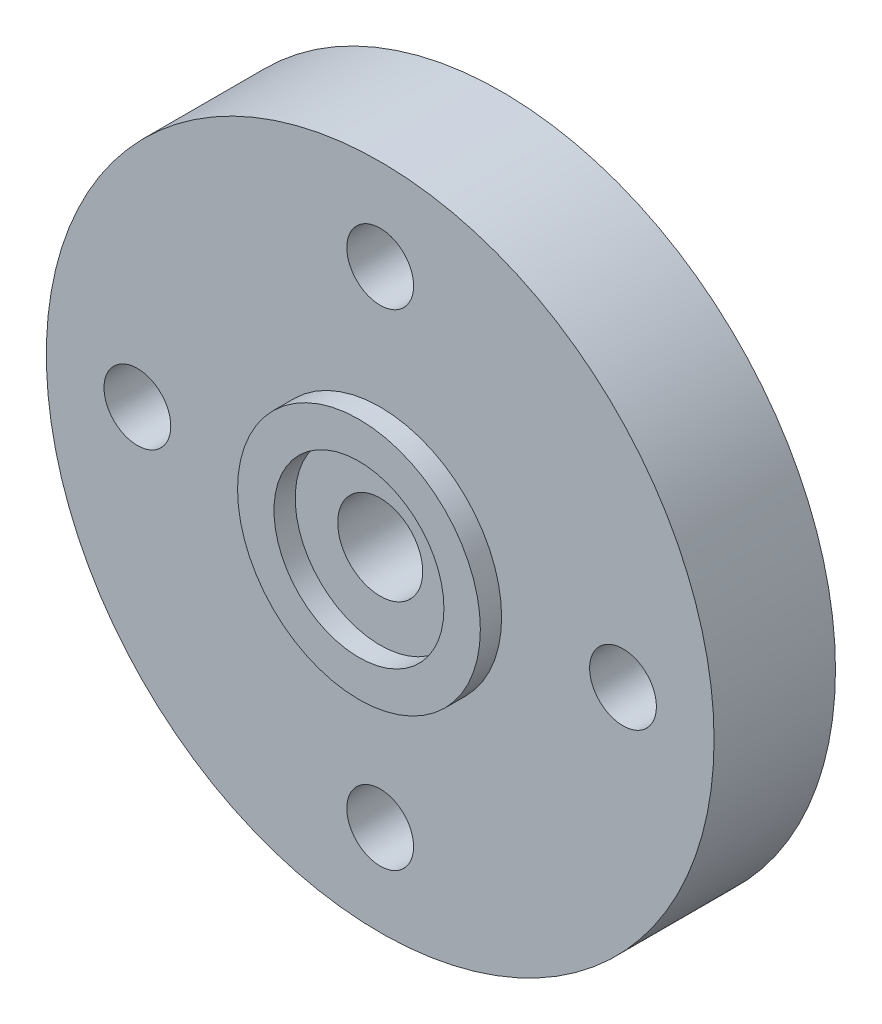
ISO-10303-21;
HEADER;
FILE_DESCRIPTION(('STEP AP214'),'2;1');
FILE_NAME('part.step','',(''),(''),'','','');
FILE_SCHEMA(('AUTOMOTIVE_DESIGN { 1 0 10303 214 1 1 1 1 }'));
ENDSEC;
DATA;
#1=APPLICATION_CONTEXT('core data for automotive mechanical design processes');
#2=APPLICATION_PROTOCOL_DEFINITION('international standard','automotive_design',2000,#1);
#3=PRODUCT_CONTEXT('',#1,'mechanical');
#4=PRODUCT('Part','Part','',(#3));
#5=PRODUCT_RELATED_PRODUCT_CATEGORY('part','',(#4));
#6=PRODUCT_DEFINITION_FORMATION('','',#4);
#7=PRODUCT_DEFINITION_CONTEXT('part definition',#1,'design');
#8=PRODUCT_DEFINITION('design','',#6,#7);
#9=PRODUCT_DEFINITION_SHAPE('','',#8);
#10=(LENGTH_UNIT() NAMED_UNIT(*) SI_UNIT(.MILLI.,.METRE.));
#11=(NAMED_UNIT(*) PLANE_ANGLE_UNIT() SI_UNIT($,.RADIAN.));
#12=(NAMED_UNIT(*) SI_UNIT($,.STERADIAN.) SOLID_ANGLE_UNIT());
#13=UNCERTAINTY_MEASURE_WITH_UNIT(LENGTH_MEASURE(1.E-05),#10,'distance_accuracy_value','');
#14=(GEOMETRIC_REPRESENTATION_CONTEXT(3) GLOBAL_UNCERTAINTY_ASSIGNED_CONTEXT((#13)) GLOBAL_UNIT_ASSIGNED_CONTEXT((#10,
#11,#12)) REPRESENTATION_CONTEXT('',''));
#15=CARTESIAN_POINT('',(0.,0.,0.));
#16=DIRECTION('',(0.,0.,1.));
#17=DIRECTION('',(1.,0.,0.));
#18=AXIS2_PLACEMENT_3D('',#15,#16,#17);
#19=CARTESIAN_POINT('',(0.,0.,4.));
#20=DIRECTION('',(0.,0.,1.));
#21=DIRECTION('',(1.,0.,0.));
#22=AXIS2_PLACEMENT_3D('',#19,#20,#21);
#23=PLANE('',#22);
#24=CARTESIAN_POINT('',(8.,0.,4.));
#25=DIRECTION('',(0.,0.,1.));
#26=DIRECTION('',(1.,0.,0.));
#27=AXIS2_PLACEMENT_3D('',#24,#25,#26);
#28=CIRCLE('',#27,1.1);
#29=CARTESIAN_POINT('',(9.1,0.,4.));
#30=VERTEX_POINT('',#29);
#31=EDGE_CURVE('E55',#30,#30,#28,.T.);
#32=ORIENTED_EDGE('',*,*,#31,.F.);
#33=EDGE_LOOP('',(#32));
#34=FACE_BOUND('',#33,.T.);
#35=CARTESIAN_POINT('',(0.,8.,4.));
#36=DIRECTION('',(0.,0.,1.));
#37=DIRECTION('',(1.,0.,0.));
#38=AXIS2_PLACEMENT_3D('',#35,#36,#37);
#39=CIRCLE('',#38,1.1);
#40=CARTESIAN_POINT('',(1.1,8.,4.));
#41=VERTEX_POINT('',#40);
#42=EDGE_CURVE('E44',#41,#41,#39,.T.);
#43=ORIENTED_EDGE('',*,*,#42,.F.);
#44=EDGE_LOOP('',(#43));
#45=FACE_BOUND('',#44,.T.);
#46=CARTESIAN_POINT('',(0.,0.,4.));
#47=DIRECTION('',(0.,0.,1.));
#48=DIRECTION('',(1.,0.,0.));
#49=AXIS2_PLACEMENT_3D('',#46,#47,#48);
#50=CIRCLE('',#49,11.);
#51=CARTESIAN_POINT('',(11.,0.,4.));
#52=VERTEX_POINT('',#51);
#53=EDGE_CURVE('E35',#52,#52,#50,.T.);
#54=ORIENTED_EDGE('',*,*,#53,.T.);
#55=EDGE_LOOP('',(#54));
#56=FACE_BOUND('',#55,.T.);
#57=CARTESIAN_POINT('',(-8.,0.,4.));
#58=DIRECTION('',(0.,0.,1.));
#59=DIRECTION('',(1.,0.,0.));
#60=AXIS2_PLACEMENT_3D('',#57,#58,#59);
#61=CIRCLE('',#60,1.1);
#62=CARTESIAN_POINT('',(-6.9,0.,4.));
#63=VERTEX_POINT('',#62);
#64=EDGE_CURVE('E49',#63,#63,#61,.T.);
#65=ORIENTED_EDGE('',*,*,#64,.F.);
#66=EDGE_LOOP('',(#65));
#67=FACE_BOUND('',#66,.T.);
#68=CARTESIAN_POINT('',(0.,-8.,4.));
#69=DIRECTION('',(0.,0.,1.));
#70=DIRECTION('',(1.,0.,0.));
#71=AXIS2_PLACEMENT_3D('',#68,#69,#70);
#72=CIRCLE('',#71,1.1);
#73=CARTESIAN_POINT('',(1.1,-8.,4.));
#74=VERTEX_POINT('',#73);
#75=EDGE_CURVE('E61',#74,#74,#72,.T.);
#76=ORIENTED_EDGE('',*,*,#75,.F.);
#77=EDGE_LOOP('',(#76));
#78=FACE_BOUND('',#77,.T.);
#79=CARTESIAN_POINT('',(0.,0.,4.));
#80=DIRECTION('',(0.,0.,1.));
#81=DIRECTION('',(1.,0.,0.));
#82=AXIS2_PLACEMENT_3D('',#79,#80,#81);
#83=CIRCLE('',#82,4.);
#84=CARTESIAN_POINT('',(4.,0.,4.));
#85=VERTEX_POINT('',#84);
#86=EDGE_CURVE('E70',#85,#85,#83,.T.);
#87=ORIENTED_EDGE('',*,*,#86,.F.);
#88=EDGE_LOOP('',(#87));
#89=FACE_BOUND('',#88,.T.);
#90=ADVANCED_FACE('F28',(#34,#45,#56,#67,#78,#89),#23,.T.);
#91=CARTESIAN_POINT('',(0.,0.,0.));
#92=DIRECTION('',(0.,0.,1.));
#93=DIRECTION('',(1.,0.,0.));
#94=AXIS2_PLACEMENT_3D('',#91,#92,#93);
#95=PLANE('',#94);
#96=CARTESIAN_POINT('',(0.,0.,0.));
#97=DIRECTION('',(0.,0.,1.));
#98=DIRECTION('',(1.,0.,0.));
#99=AXIS2_PLACEMENT_3D('',#96,#97,#98);
#100=CIRCLE('',#99,1.4);
#101=CARTESIAN_POINT('',(1.4,0.,0.));
#102=VERTEX_POINT('',#101);
#103=EDGE_CURVE('E78',#102,#102,#100,.F.);
#104=ORIENTED_EDGE('',*,*,#103,.F.);
#105=EDGE_LOOP('',(#104));
#106=FACE_BOUND('',#105,.T.);
#107=CARTESIAN_POINT('',(8.,0.,0.));
#108=DIRECTION('',(0.,0.,1.));
#109=DIRECTION('',(1.,0.,0.));
#110=AXIS2_PLACEMENT_3D('',#107,#108,#109);
#111=CIRCLE('',#110,1.1);
#112=CARTESIAN_POINT('',(9.1,0.,0.));
#113=VERTEX_POINT('',#112);
#114=EDGE_CURVE('E58',#113,#113,#111,.T.);
#115=ORIENTED_EDGE('',*,*,#114,.T.);
#116=EDGE_LOOP('',(#115));
#117=FACE_BOUND('',#116,.T.);
#118=CARTESIAN_POINT('',(0.,8.,0.));
#119=DIRECTION('',(0.,0.,1.));
#120=DIRECTION('',(1.,0.,0.));
#121=AXIS2_PLACEMENT_3D('',#118,#119,#120);
#122=CIRCLE('',#121,1.1);
#123=CARTESIAN_POINT('',(1.1,8.,0.));
#124=VERTEX_POINT('',#123);
#125=EDGE_CURVE('E46',#124,#124,#122,.T.);
#126=ORIENTED_EDGE('',*,*,#125,.T.);
#127=EDGE_LOOP('',(#126));
#128=FACE_BOUND('',#127,.T.);
#129=CARTESIAN_POINT('',(0.,0.,0.));
#130=DIRECTION('',(0.,0.,1.));
#131=DIRECTION('',(1.,0.,0.));
#132=AXIS2_PLACEMENT_3D('',#129,#130,#131);
#133=CIRCLE('',#132,11.);
#134=CARTESIAN_POINT('',(11.,0.,0.));
#135=VERTEX_POINT('',#134);
#136=EDGE_CURVE('E39',#135,#135,#133,.T.);
#137=ORIENTED_EDGE('',*,*,#136,.F.);
#138=EDGE_LOOP('',(#137));
#139=FACE_BOUND('',#138,.T.);
#140=CARTESIAN_POINT('',(-8.,0.,0.));
#141=DIRECTION('',(0.,0.,1.));
#142=DIRECTION('',(1.,0.,0.));
#143=AXIS2_PLACEMENT_3D('',#140,#141,#142);
#144=CIRCLE('',#143,1.1);
#145=CARTESIAN_POINT('',(-6.9,0.,0.));
#146=VERTEX_POINT('',#145);
#147=EDGE_CURVE('E52',#146,#146,#144,.T.);
#148=ORIENTED_EDGE('',*,*,#147,.T.);
#149=EDGE_LOOP('',(#148));
#150=FACE_BOUND('',#149,.T.);
#151=CARTESIAN_POINT('',(0.,-8.,0.));
#152=DIRECTION('',(0.,0.,1.));
#153=DIRECTION('',(1.,0.,0.));
#154=AXIS2_PLACEMENT_3D('',#151,#152,#153);
#155=CIRCLE('',#154,1.1);
#156=CARTESIAN_POINT('',(1.1,-8.,0.));
#157=VERTEX_POINT('',#156);
#158=EDGE_CURVE('E64',#157,#157,#155,.T.);
#159=ORIENTED_EDGE('',*,*,#158,.T.);
#160=EDGE_LOOP('',(#159));
#161=FACE_BOUND('',#160,.T.);
#162=ADVANCED_FACE('F103',(#106,#117,#128,#139,#150,#161),#95,.F.);
#163=CARTESIAN_POINT('',(0.,0.,4.));
#164=DIRECTION('',(0.,0.,-1.));
#165=DIRECTION('',(-1.,0.,0.));
#166=AXIS2_PLACEMENT_3D('',#163,#164,#165);
#167=CYLINDRICAL_SURFACE('',#166,11.);
#168=ORIENTED_EDGE('',*,*,#53,.F.);
#169=EDGE_LOOP('',(#168));
#170=FACE_BOUND('',#169,.T.);
#171=ORIENTED_EDGE('',*,*,#136,.T.);
#172=EDGE_LOOP('',(#171));
#173=FACE_BOUND('',#172,.T.);
#174=ADVANCED_FACE('F30',(#170,#173),#167,.T.);
#175=CARTESIAN_POINT('',(0.,8.,4.));
#176=DIRECTION('',(0.,0.,-1.));
#177=DIRECTION('',(-1.,0.,0.));
#178=AXIS2_PLACEMENT_3D('',#175,#176,#177);
#179=CYLINDRICAL_SURFACE('',#178,1.1);
#180=ORIENTED_EDGE('',*,*,#42,.T.);
#181=EDGE_LOOP('',(#180));
#182=FACE_BOUND('',#181,.T.);
#183=ORIENTED_EDGE('',*,*,#125,.F.);
#184=EDGE_LOOP('',(#183));
#185=FACE_BOUND('',#184,.T.);
#186=ADVANCED_FACE('F140',(#182,#185),#179,.F.);
#187=CARTESIAN_POINT('',(-8.,0.,4.));
#188=DIRECTION('',(0.,0.,-1.));
#189=DIRECTION('',(-1.,0.,0.));
#190=AXIS2_PLACEMENT_3D('',#187,#188,#189);
#191=CYLINDRICAL_SURFACE('',#190,1.1);
#192=ORIENTED_EDGE('',*,*,#64,.T.);
#193=EDGE_LOOP('',(#192));
#194=FACE_BOUND('',#193,.T.);
#195=ORIENTED_EDGE('',*,*,#147,.F.);
#196=EDGE_LOOP('',(#195));
#197=FACE_BOUND('',#196,.T.);
#198=ADVANCED_FACE('F137',(#194,#197),#191,.F.);
#199=CARTESIAN_POINT('',(8.,0.,4.));
#200=DIRECTION('',(0.,0.,-1.));
#201=DIRECTION('',(-1.,0.,0.));
#202=AXIS2_PLACEMENT_3D('',#199,#200,#201);
#203=CYLINDRICAL_SURFACE('',#202,1.1);
#204=ORIENTED_EDGE('',*,*,#31,.T.);
#205=EDGE_LOOP('',(#204));
#206=FACE_BOUND('',#205,.T.);
#207=ORIENTED_EDGE('',*,*,#114,.F.);
#208=EDGE_LOOP('',(#207));
#209=FACE_BOUND('',#208,.T.);
#210=ADVANCED_FACE('F133',(#206,#209),#203,.F.);
#211=CARTESIAN_POINT('',(0.,-8.,4.));
#212=DIRECTION('',(0.,0.,-1.));
#213=DIRECTION('',(-1.,0.,0.));
#214=AXIS2_PLACEMENT_3D('',#211,#212,#213);
#215=CYLINDRICAL_SURFACE('',#214,1.1);
#216=ORIENTED_EDGE('',*,*,#75,.T.);
#217=EDGE_LOOP('',(#216));
#218=FACE_BOUND('',#217,.T.);
#219=ORIENTED_EDGE('',*,*,#158,.F.);
#220=EDGE_LOOP('',(#219));
#221=FACE_BOUND('',#220,.T.);
#222=ADVANCED_FACE('F126',(#218,#221),#215,.F.);
#223=CARTESIAN_POINT('',(0.,0.,4.7));
#224=DIRECTION('',(0.,0.,1.));
#225=DIRECTION('',(1.,0.,0.));
#226=AXIS2_PLACEMENT_3D('',#223,#224,#225);
#227=PLANE('',#226);
#228=CARTESIAN_POINT('',(0.,0.,4.7));
#229=DIRECTION('',(0.,0.,1.));
#230=DIRECTION('',(1.,0.,0.));
#231=AXIS2_PLACEMENT_3D('',#228,#229,#230);
#232=CIRCLE('',#231,4.);
#233=CARTESIAN_POINT('',(4.,0.,4.7));
#234=VERTEX_POINT('',#233);
#235=EDGE_CURVE('E67',#234,#234,#232,.T.);
#236=ORIENTED_EDGE('',*,*,#235,.T.);
#237=EDGE_LOOP('',(#236));
#238=FACE_BOUND('',#237,.T.);
#239=CARTESIAN_POINT('',(0.,0.,4.7));
#240=DIRECTION('',(0.,0.,1.));
#241=DIRECTION('',(1.,0.,0.));
#242=AXIS2_PLACEMENT_3D('',#239,#240,#241);
#243=CIRCLE('',#242,2.8);
#244=CARTESIAN_POINT('',(2.8,0.,4.7));
#245=VERTEX_POINT('',#244);
#246=EDGE_CURVE('E73',#245,#245,#243,.T.);
#247=ORIENTED_EDGE('',*,*,#246,.F.);
#248=EDGE_LOOP('',(#247));
#249=FACE_BOUND('',#248,.T.);
#250=ADVANCED_FACE('F120',(#238,#249),#227,.T.);
#251=CARTESIAN_POINT('',(0.,0.,4.7));
#252=DIRECTION('',(0.,0.,-1.));
#253=DIRECTION('',(-1.,0.,0.));
#254=AXIS2_PLACEMENT_3D('',#251,#252,#253);
#255=CYLINDRICAL_SURFACE('',#254,4.);
#256=ORIENTED_EDGE('',*,*,#235,.F.);
#257=EDGE_LOOP('',(#256));
#258=FACE_BOUND('',#257,.T.);
#259=ORIENTED_EDGE('',*,*,#86,.T.);
#260=EDGE_LOOP('',(#259));
#261=FACE_BOUND('',#260,.T.);
#262=ADVANCED_FACE('F98',(#258,#261),#255,.T.);
#263=CARTESIAN_POINT('',(0.,0.,4.7));
#264=DIRECTION('',(0.,0.,-1.));
#265=DIRECTION('',(-1.,0.,0.));
#266=AXIS2_PLACEMENT_3D('',#263,#264,#265);
#267=CYLINDRICAL_SURFACE('',#266,2.8);
#268=ORIENTED_EDGE('',*,*,#246,.T.);
#269=EDGE_LOOP('',(#268));
#270=FACE_BOUND('',#269,.T.);
#271=CARTESIAN_POINT('',(0.,0.,4.));
#272=DIRECTION('',(0.,0.,1.));
#273=DIRECTION('',(1.,0.,0.));
#274=AXIS2_PLACEMENT_3D('',#271,#272,#273);
#275=CIRCLE('',#274,2.8);
#276=CARTESIAN_POINT('',(2.8,0.,4.));
#277=VERTEX_POINT('',#276);
#278=EDGE_CURVE('E10',#277,#277,#275,.F.);
#279=ORIENTED_EDGE('',*,*,#278,.T.);
#280=EDGE_LOOP('',(#279));
#281=FACE_BOUND('',#280,.T.);
#282=ADVANCED_FACE('F91',(#270,#281),#267,.F.);
#283=CARTESIAN_POINT('',(0.,0.,4.));
#284=DIRECTION('',(0.,0.,1.));
#285=DIRECTION('',(1.,0.,0.));
#286=AXIS2_PLACEMENT_3D('',#283,#284,#285);
#287=CIRCLE('',#286,1.4);
#288=CARTESIAN_POINT('',(1.4,0.,4.));
#289=VERTEX_POINT('',#288);
#290=EDGE_CURVE('E81',#289,#289,#287,.T.);
#291=ORIENTED_EDGE('',*,*,#290,.F.);
#292=EDGE_LOOP('',(#291));
#293=FACE_BOUND('',#292,.T.);
#294=ORIENTED_EDGE('',*,*,#278,.F.);
#295=EDGE_LOOP('',(#294));
#296=FACE_BOUND('',#295,.T.);
#297=ADVANCED_FACE('F88',(#293,#296),#23,.T.);
#298=CARTESIAN_POINT('',(0.,0.,-0.00100000000000013));
#299=DIRECTION('',(0.,0.,1.));
#300=DIRECTION('',(1.,0.,0.));
#301=AXIS2_PLACEMENT_3D('',#298,#299,#300);
#302=CYLINDRICAL_SURFACE('',#301,1.4);
#303=ORIENTED_EDGE('',*,*,#290,.T.);
#304=EDGE_LOOP('',(#303));
#305=FACE_BOUND('',#304,.T.);
#306=ORIENTED_EDGE('',*,*,#103,.T.);
#307=EDGE_LOOP('',(#306));
#308=FACE_BOUND('',#307,.T.);
#309=ADVANCED_FACE('F85',(#305,#308),#302,.F.);
#310=CLOSED_SHELL('',(#90,#162,#174,#186,#198,#210,#222,#250,#262,#282,#297,#309));
#311=MANIFOLD_SOLID_BREP('B2',#310);
#312=ADVANCED_BREP_SHAPE_REPRESENTATION('',(#18,#311),#14);
#313=SHAPE_DEFINITION_REPRESENTATION(#9,#312);
ENDSEC;
END-ISO-10303-21;
